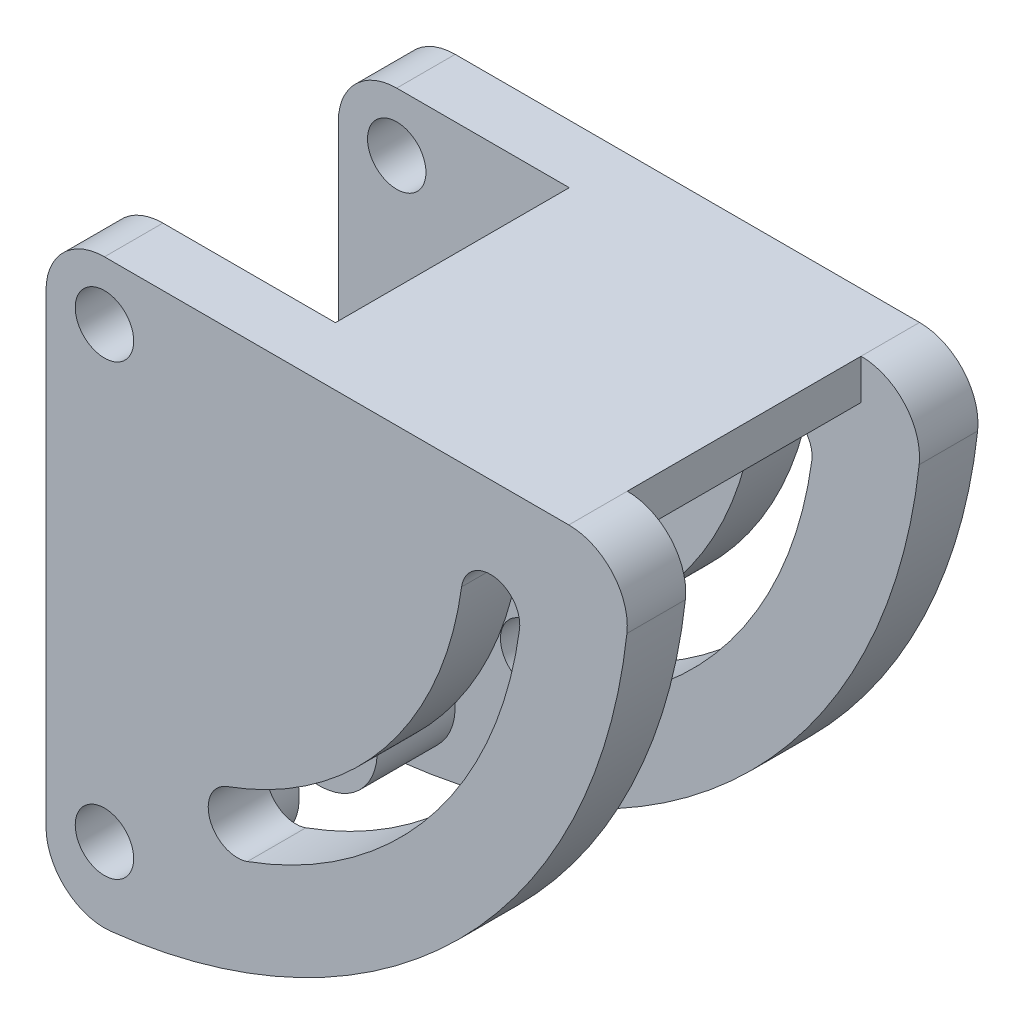
ISO-10303-21;
HEADER;
FILE_DESCRIPTION(('STEP AP214'),'2;1');
FILE_NAME('part.step','',(''),(''),'','','');
FILE_SCHEMA(('AUTOMOTIVE_DESIGN { 1 0 10303 214 1 1 1 1 }'));
ENDSEC;
DATA;
#1=APPLICATION_CONTEXT('core data for automotive mechanical design processes');
#2=APPLICATION_PROTOCOL_DEFINITION('international standard','automotive_design',2000,#1);
#3=PRODUCT_CONTEXT('',#1,'mechanical');
#4=PRODUCT('Part','Part','',(#3));
#5=PRODUCT_RELATED_PRODUCT_CATEGORY('part','',(#4));
#6=PRODUCT_DEFINITION_FORMATION('','',#4);
#7=PRODUCT_DEFINITION_CONTEXT('part definition',#1,'design');
#8=PRODUCT_DEFINITION('design','',#6,#7);
#9=PRODUCT_DEFINITION_SHAPE('','',#8);
#10=(LENGTH_UNIT() NAMED_UNIT(*) SI_UNIT(.MILLI.,.METRE.));
#11=(NAMED_UNIT(*) PLANE_ANGLE_UNIT() SI_UNIT($,.RADIAN.));
#12=(NAMED_UNIT(*) SI_UNIT($,.STERADIAN.) SOLID_ANGLE_UNIT());
#13=UNCERTAINTY_MEASURE_WITH_UNIT(LENGTH_MEASURE(1.E-05),#10,'distance_accuracy_value','');
#14=(GEOMETRIC_REPRESENTATION_CONTEXT(3) GLOBAL_UNCERTAINTY_ASSIGNED_CONTEXT((#13)) GLOBAL_UNIT_ASSIGNED_CONTEXT((#10,
#11,#12)) REPRESENTATION_CONTEXT('',''));
#15=CARTESIAN_POINT('',(0.,0.,0.));
#16=DIRECTION('',(0.,0.,1.));
#17=DIRECTION('',(1.,0.,0.));
#18=AXIS2_PLACEMENT_3D('',#15,#16,#17);
#19=CARTESIAN_POINT('',(0.,0.,3.));
#20=DIRECTION('',(0.,0.,1.));
#21=DIRECTION('',(1.,0.,0.));
#22=AXIS2_PLACEMENT_3D('',#19,#20,#21);
#23=PLANE('',#22);
#24=CARTESIAN_POINT('',(3.,-3.,3.));
#25=DIRECTION('',(0.,0.,1.));
#26=DIRECTION('',(1.,0.,0.));
#27=AXIS2_PLACEMENT_3D('',#24,#25,#26);
#28=CIRCLE('',#27,1.5);
#29=CARTESIAN_POINT('',(4.5,-3.,3.));
#30=VERTEX_POINT('',#29);
#31=EDGE_CURVE('E278',#30,#30,#28,.T.);
#32=ORIENTED_EDGE('',*,*,#31,.F.);
#33=EDGE_LOOP('',(#32));
#34=FACE_BOUND('',#33,.T.);
#35=CARTESIAN_POINT('',(3.,-3.,3.));
#36=DIRECTION('',(0.,0.,1.));
#37=DIRECTION('',(1.,0.,0.));
#38=AXIS2_PLACEMENT_3D('',#35,#36,#37);
#39=CIRCLE('',#38,21.5);
#40=CARTESIAN_POINT('',(10.3368607416251,-23.209415490261,3.));
#41=VERTEX_POINT('',#40);
#42=CARTESIAN_POINT('',(24.3019173366732,-5.91175510329082,3.));
#43=VERTEX_POINT('',#42);
#44=EDGE_CURVE('E289',#41,#43,#39,.T.);
#45=ORIENTED_EDGE('',*,*,#44,.F.);
#46=CARTESIAN_POINT('',(9.82498673639547,-21.7994562700102,3.));
#47=DIRECTION('',(0.,0.,1.));
#48=DIRECTION('',(1.,0.,0.));
#49=AXIS2_PLACEMENT_3D('',#46,#47,#48);
#50=CIRCLE('',#49,1.5);
#51=CARTESIAN_POINT('',(9.31311273116582,-20.3894970497594,3.));
#52=VERTEX_POINT('',#51);
#53=EDGE_CURVE('E287',#52,#41,#50,.T.);
#54=ORIENTED_EDGE('',*,*,#53,.F.);
#55=CARTESIAN_POINT('',(3.,-3.,3.));
#56=DIRECTION('',(0.,0.,-1.));
#57=DIRECTION('',(-1.,0.,0.));
#58=AXIS2_PLACEMENT_3D('',#55,#56,#57);
#59=CIRCLE('',#58,18.5);
#60=CARTESIAN_POINT('',(21.3295567780677,-5.5054636935293,3.));
#61=VERTEX_POINT('',#60);
#62=EDGE_CURVE('E295',#61,#52,#59,.T.);
#63=ORIENTED_EDGE('',*,*,#62,.F.);
#64=CARTESIAN_POINT('',(22.8157370573705,-5.70860939841005,3.));
#65=DIRECTION('',(0.,0.,1.));
#66=DIRECTION('',(1.,0.,0.));
#67=AXIS2_PLACEMENT_3D('',#64,#65,#66);
#68=CIRCLE('',#67,1.5);
#69=EDGE_CURVE('E292',#43,#61,#68,.T.);
#70=ORIENTED_EDGE('',*,*,#69,.F.);
#71=EDGE_LOOP('',(#45,#54,#63,#70));
#72=FACE_BOUND('',#71,.T.);
#73=DIRECTION('',(0.,-1.,0.));
#74=VECTOR('',#73,1.);
#75=CARTESIAN_POINT('',(0.,0.,3.));
#76=LINE('',#75,#74);
#77=CARTESIAN_POINT('',(0.,-3.,3.));
#78=VERTEX_POINT('',#77);
#79=CARTESIAN_POINT('',(0.,-26.,3.));
#80=VERTEX_POINT('',#79);
#81=EDGE_CURVE('E318',#78,#80,#76,.T.);
#82=ORIENTED_EDGE('',*,*,#81,.T.);
#83=CARTESIAN_POINT('',(3.,-26.,3.));
#84=DIRECTION('',(0.,0.,-1.));
#85=DIRECTION('',(-1.,0.,0.));
#86=AXIS2_PLACEMENT_3D('',#83,#84,#85);
#87=CIRCLE('',#86,3.);
#88=EDGE_CURVE('E47',#80,#80,#87,.T.);
#89=ORIENTED_EDGE('',*,*,#88,.T.);
#90=CARTESIAN_POINT('',(0.,-26.8328157299975,3.));
#91=VERTEX_POINT('',#90);
#92=EDGE_CURVE('E322',#80,#91,#76,.T.);
#93=ORIENTED_EDGE('',*,*,#92,.T.);
#94=CARTESIAN_POINT('',(3.,-26.8328157299975,3.));
#95=DIRECTION('',(0.,0.,1.));
#96=DIRECTION('',(1.,0.,0.));
#97=AXIS2_PLACEMENT_3D('',#94,#95,#96);
#98=CIRCLE('',#97,3.);
#99=CARTESIAN_POINT('',(3.33333333333334,-29.8142396999972,3.));
#100=VERTEX_POINT('',#99);
#101=EDGE_CURVE('E352',#91,#100,#98,.T.);
#102=ORIENTED_EDGE('',*,*,#101,.T.);
#103=CARTESIAN_POINT('',(0.,0.,3.));
#104=DIRECTION('',(0.,0.,1.));
#105=DIRECTION('',(1.,0.,0.));
#106=AXIS2_PLACEMENT_3D('',#103,#104,#105);
#107=CIRCLE('',#106,30.);
#108=CARTESIAN_POINT('',(29.8142396999972,-3.33333333333334,3.));
#109=VERTEX_POINT('',#108);
#110=EDGE_CURVE('E321',#100,#109,#107,.T.);
#111=ORIENTED_EDGE('',*,*,#110,.T.);
#112=CARTESIAN_POINT('',(26.8328157299975,-3.,3.));
#113=DIRECTION('',(0.,0.,1.));
#114=DIRECTION('',(1.,0.,0.));
#115=AXIS2_PLACEMENT_3D('',#112,#113,#114);
#116=CIRCLE('',#115,3.);
#117=CARTESIAN_POINT('',(26.8328157299975,0.,3.));
#118=VERTEX_POINT('',#117);
#119=EDGE_CURVE('E356',#109,#118,#116,.T.);
#120=ORIENTED_EDGE('',*,*,#119,.T.);
#121=DIRECTION('',(0.,1.,0.));
#122=VECTOR('',#121,1.);
#123=CARTESIAN_POINT('',(26.8328157299975,0.,3.));
#124=LINE('',#123,#122);
#125=CARTESIAN_POINT('',(26.8328157299975,-2.05882384585721,3.));
#126=VERTEX_POINT('',#125);
#127=EDGE_CURVE('E251',#126,#118,#124,.T.);
#128=ORIENTED_EDGE('',*,*,#127,.F.);
#129=DIRECTION('',(1.,0.,0.));
#130=VECTOR('',#129,1.);
#131=CARTESIAN_POINT('',(11.8552999571762,-2.05882384585721,3.));
#132=LINE('',#131,#130);
#133=CARTESIAN_POINT('',(11.8552999571762,-2.05882384585721,3.));
#134=VERTEX_POINT('',#133);
#135=EDGE_CURVE('E54',#134,#126,#132,.T.);
#136=ORIENTED_EDGE('',*,*,#135,.F.);
#137=DIRECTION('',(0.,-1.,0.));
#138=VECTOR('',#137,1.);
#139=CARTESIAN_POINT('',(11.8552999571762,0.,3.));
#140=LINE('',#139,#138);
#141=CARTESIAN_POINT('',(11.8552999571762,0.,3.));
#142=VERTEX_POINT('',#141);
#143=EDGE_CURVE('E255',#142,#134,#140,.T.);
#144=ORIENTED_EDGE('',*,*,#143,.F.);
#145=DIRECTION('',(-1.,0.,0.));
#146=VECTOR('',#145,1.);
#147=CARTESIAN_POINT('',(0.,0.,3.));
#148=LINE('',#147,#146);
#149=CARTESIAN_POINT('',(3.,0.,3.));
#150=VERTEX_POINT('',#149);
#151=EDGE_CURVE('E325',#142,#150,#148,.T.);
#152=ORIENTED_EDGE('',*,*,#151,.T.);
#153=CARTESIAN_POINT('',(3.,-3.,3.));
#154=DIRECTION('',(0.,0.,1.));
#155=DIRECTION('',(1.,0.,0.));
#156=AXIS2_PLACEMENT_3D('',#153,#154,#155);
#157=CIRCLE('',#156,3.);
#158=EDGE_CURVE('E354',#150,#78,#157,.T.);
#159=ORIENTED_EDGE('',*,*,#158,.T.);
#160=EDGE_LOOP('',(#82,#89,#93,#102,#111,#120,#128,#136,#144,#152,#159));
#161=FACE_BOUND('',#160,.T.);
#162=ADVANCED_FACE('F34',(#34,#72,#161),#23,.T.);
#163=CARTESIAN_POINT('',(0.,0.,15.));
#164=DIRECTION('',(0.,0.,1.));
#165=DIRECTION('',(1.,0.,0.));
#166=AXIS2_PLACEMENT_3D('',#163,#164,#165);
#167=PLANE('',#166);
#168=CARTESIAN_POINT('',(3.,-3.,15.));
#169=DIRECTION('',(0.,0.,1.));
#170=DIRECTION('',(1.,0.,0.));
#171=AXIS2_PLACEMENT_3D('',#168,#169,#170);
#172=CIRCLE('',#171,1.5);
#173=CARTESIAN_POINT('',(4.5,-3.,15.));
#174=VERTEX_POINT('',#173);
#175=EDGE_CURVE('E532',#174,#174,#172,.T.);
#176=ORIENTED_EDGE('',*,*,#175,.T.);
#177=EDGE_LOOP('',(#176));
#178=FACE_BOUND('',#177,.T.);
#179=CARTESIAN_POINT('',(9.82498673639547,-21.7994562700102,15.));
#180=DIRECTION('',(0.,0.,1.));
#181=DIRECTION('',(1.,0.,0.));
#182=AXIS2_PLACEMENT_3D('',#179,#180,#181);
#183=CIRCLE('',#182,1.5);
#184=CARTESIAN_POINT('',(9.31311273116582,-20.3894970497594,15.));
#185=VERTEX_POINT('',#184);
#186=CARTESIAN_POINT('',(10.3368607416251,-23.209415490261,15.));
#187=VERTEX_POINT('',#186);
#188=EDGE_CURVE('E542',#185,#187,#183,.T.);
#189=ORIENTED_EDGE('',*,*,#188,.T.);
#190=CARTESIAN_POINT('',(3.,-3.,15.));
#191=DIRECTION('',(0.,0.,1.));
#192=DIRECTION('',(1.,0.,0.));
#193=AXIS2_PLACEMENT_3D('',#190,#191,#192);
#194=CIRCLE('',#193,21.5);
#195=CARTESIAN_POINT('',(24.3019173366732,-5.91175510329082,15.));
#196=VERTEX_POINT('',#195);
#197=EDGE_CURVE('E556',#187,#196,#194,.T.);
#198=ORIENTED_EDGE('',*,*,#197,.T.);
#199=CARTESIAN_POINT('',(22.8157370573705,-5.70860939841005,15.));
#200=DIRECTION('',(0.,0.,1.));
#201=DIRECTION('',(1.,0.,0.));
#202=AXIS2_PLACEMENT_3D('',#199,#200,#201);
#203=CIRCLE('',#202,1.5);
#204=CARTESIAN_POINT('',(21.3295567780677,-5.5054636935293,15.));
#205=VERTEX_POINT('',#204);
#206=EDGE_CURVE('E559',#196,#205,#203,.T.);
#207=ORIENTED_EDGE('',*,*,#206,.T.);
#208=CARTESIAN_POINT('',(3.,-3.,15.));
#209=DIRECTION('',(0.,0.,-1.));
#210=DIRECTION('',(-1.,0.,0.));
#211=AXIS2_PLACEMENT_3D('',#208,#209,#210);
#212=CIRCLE('',#211,18.5);
#213=EDGE_CURVE('E546',#205,#185,#212,.T.);
#214=ORIENTED_EDGE('',*,*,#213,.T.);
#215=EDGE_LOOP('',(#189,#198,#207,#214));
#216=FACE_BOUND('',#215,.T.);
#217=DIRECTION('',(0.,-1.,0.));
#218=VECTOR('',#217,1.);
#219=CARTESIAN_POINT('',(0.,0.,15.));
#220=LINE('',#219,#218);
#221=CARTESIAN_POINT('',(0.,-26.,15.));
#222=VERTEX_POINT('',#221);
#223=CARTESIAN_POINT('',(0.,-26.8328157299975,15.));
#224=VERTEX_POINT('',#223);
#225=EDGE_CURVE('E198',#222,#224,#220,.T.);
#226=ORIENTED_EDGE('',*,*,#225,.F.);
#227=CARTESIAN_POINT('',(3.,-26.,15.));
#228=DIRECTION('',(0.,0.,-1.));
#229=DIRECTION('',(-1.,0.,0.));
#230=AXIS2_PLACEMENT_3D('',#227,#228,#229);
#231=CIRCLE('',#230,3.);
#232=EDGE_CURVE('E209',#222,#222,#231,.T.);
#233=ORIENTED_EDGE('',*,*,#232,.F.);
#234=CARTESIAN_POINT('',(0.,-3.,15.));
#235=VERTEX_POINT('',#234);
#236=EDGE_CURVE('E194',#235,#222,#220,.T.);
#237=ORIENTED_EDGE('',*,*,#236,.F.);
#238=CARTESIAN_POINT('',(3.,-3.,15.));
#239=DIRECTION('',(0.,0.,1.));
#240=DIRECTION('',(1.,0.,0.));
#241=AXIS2_PLACEMENT_3D('',#238,#239,#240);
#242=CIRCLE('',#241,3.);
#243=CARTESIAN_POINT('',(3.,0.,15.));
#244=VERTEX_POINT('',#243);
#245=EDGE_CURVE('E232',#235,#244,#242,.F.);
#246=ORIENTED_EDGE('',*,*,#245,.T.);
#247=DIRECTION('',(-1.,0.,0.));
#248=VECTOR('',#247,1.);
#249=CARTESIAN_POINT('',(0.,0.,15.));
#250=LINE('',#249,#248);
#251=CARTESIAN_POINT('',(11.8552999571762,0.,14.9999999999864));
#252=VERTEX_POINT('',#251);
#253=EDGE_CURVE('E223',#252,#244,#250,.T.);
#254=ORIENTED_EDGE('',*,*,#253,.F.);
#255=DIRECTION('',(0.,-1.,0.));
#256=VECTOR('',#255,1.);
#257=CARTESIAN_POINT('',(11.8552999571762,0.,14.9999999999864));
#258=LINE('',#257,#256);
#259=CARTESIAN_POINT('',(11.8552999571762,-2.05882384585721,14.9999999999864));
#260=VERTEX_POINT('',#259);
#261=EDGE_CURVE('E263',#252,#260,#258,.T.);
#262=ORIENTED_EDGE('',*,*,#261,.T.);
#263=DIRECTION('',(1.,0.,0.));
#264=VECTOR('',#263,1.);
#265=CARTESIAN_POINT('',(11.8552999571762,-2.05882384585721,14.9999999999864));
#266=LINE('',#265,#264);
#267=CARTESIAN_POINT('',(26.8328157299975,-2.05882384585721,14.9999999999864));
#268=VERTEX_POINT('',#267);
#269=EDGE_CURVE('E273',#260,#268,#266,.T.);
#270=ORIENTED_EDGE('',*,*,#269,.T.);
#271=DIRECTION('',(0.,1.,0.));
#272=VECTOR('',#271,1.);
#273=CARTESIAN_POINT('',(26.8328157299975,0.,14.9999999999864));
#274=LINE('',#273,#272);
#275=CARTESIAN_POINT('',(26.8328157299975,0.,15.));
#276=VERTEX_POINT('',#275);
#277=EDGE_CURVE('E250',#268,#276,#274,.T.);
#278=ORIENTED_EDGE('',*,*,#277,.T.);
#279=CARTESIAN_POINT('',(26.8328157299975,-3.,15.));
#280=DIRECTION('',(0.,0.,1.));
#281=DIRECTION('',(1.,0.,0.));
#282=AXIS2_PLACEMENT_3D('',#279,#280,#281);
#283=CIRCLE('',#282,3.);
#284=CARTESIAN_POINT('',(29.8142396999972,-3.33333333333334,15.));
#285=VERTEX_POINT('',#284);
#286=EDGE_CURVE('E234',#276,#285,#283,.F.);
#287=ORIENTED_EDGE('',*,*,#286,.T.);
#288=CARTESIAN_POINT('',(0.,0.,15.));
#289=DIRECTION('',(0.,0.,1.));
#290=DIRECTION('',(1.,0.,0.));
#291=AXIS2_PLACEMENT_3D('',#288,#289,#290);
#292=CIRCLE('',#291,30.);
#293=CARTESIAN_POINT('',(3.33333333333334,-29.8142396999972,15.));
#294=VERTEX_POINT('',#293);
#295=EDGE_CURVE('E205',#294,#285,#292,.T.);
#296=ORIENTED_EDGE('',*,*,#295,.F.);
#297=CARTESIAN_POINT('',(3.,-26.8328157299975,15.));
#298=DIRECTION('',(0.,0.,1.));
#299=DIRECTION('',(1.,0.,0.));
#300=AXIS2_PLACEMENT_3D('',#297,#298,#299);
#301=CIRCLE('',#300,3.);
#302=EDGE_CURVE('E211',#294,#224,#301,.F.);
#303=ORIENTED_EDGE('',*,*,#302,.T.);
#304=EDGE_LOOP('',(#226,#233,#237,#246,#254,#262,#270,#278,#287,#296,#303));
#305=FACE_BOUND('',#304,.T.);
#306=ADVANCED_FACE('F207',(#178,#216,#305),#167,.F.);
#307=CARTESIAN_POINT('',(0.,0.,0.));
#308=DIRECTION('',(0.,0.,1.));
#309=DIRECTION('',(1.,0.,0.));
#310=AXIS2_PLACEMENT_3D('',#307,#308,#309);
#311=PLANE('',#310);
#312=DIRECTION('',(-1.,0.,0.));
#313=VECTOR('',#312,1.);
#314=CARTESIAN_POINT('',(0.,0.,0.));
#315=LINE('',#314,#313);
#316=CARTESIAN_POINT('',(26.8328157299975,0.,0.));
#317=VERTEX_POINT('',#316);
#318=CARTESIAN_POINT('',(3.,0.,0.));
#319=VERTEX_POINT('',#318);
#320=EDGE_CURVE('E333',#317,#319,#315,.T.);
#321=ORIENTED_EDGE('',*,*,#320,.F.);
#322=CARTESIAN_POINT('',(26.8328157299975,-3.,0.));
#323=DIRECTION('',(0.,0.,1.));
#324=DIRECTION('',(1.,0.,0.));
#325=AXIS2_PLACEMENT_3D('',#322,#323,#324);
#326=CIRCLE('',#325,3.);
#327=CARTESIAN_POINT('',(29.8142396999972,-3.33333333333334,0.));
#328=VERTEX_POINT('',#327);
#329=EDGE_CURVE('E345',#317,#328,#326,.F.);
#330=ORIENTED_EDGE('',*,*,#329,.T.);
#331=CARTESIAN_POINT('',(0.,0.,0.));
#332=DIRECTION('',(0.,0.,1.));
#333=DIRECTION('',(1.,0.,0.));
#334=AXIS2_PLACEMENT_3D('',#331,#332,#333);
#335=CIRCLE('',#334,30.);
#336=CARTESIAN_POINT('',(3.33333333333334,-29.8142396999972,0.));
#337=VERTEX_POINT('',#336);
#338=EDGE_CURVE('E330',#337,#328,#335,.T.);
#339=ORIENTED_EDGE('',*,*,#338,.F.);
#340=CARTESIAN_POINT('',(3.,-26.8328157299975,0.));
#341=DIRECTION('',(0.,0.,1.));
#342=DIRECTION('',(1.,0.,0.));
#343=AXIS2_PLACEMENT_3D('',#340,#341,#342);
#344=CIRCLE('',#343,3.);
#345=CARTESIAN_POINT('',(0.,-26.8328157299975,0.));
#346=VERTEX_POINT('',#345);
#347=EDGE_CURVE('E341',#337,#346,#344,.F.);
#348=ORIENTED_EDGE('',*,*,#347,.T.);
#349=DIRECTION('',(0.,-1.,0.));
#350=VECTOR('',#349,1.);
#351=CARTESIAN_POINT('',(0.,0.,0.));
#352=LINE('',#351,#350);
#353=CARTESIAN_POINT('',(0.,-3.,0.));
#354=VERTEX_POINT('',#353);
#355=EDGE_CURVE('E317',#354,#346,#352,.T.);
#356=ORIENTED_EDGE('',*,*,#355,.F.);
#357=CARTESIAN_POINT('',(3.,-3.,0.));
#358=DIRECTION('',(0.,0.,1.));
#359=DIRECTION('',(1.,0.,0.));
#360=AXIS2_PLACEMENT_3D('',#357,#358,#359);
#361=CIRCLE('',#360,3.);
#362=EDGE_CURVE('E343',#354,#319,#361,.F.);
#363=ORIENTED_EDGE('',*,*,#362,.T.);
#364=EDGE_LOOP('',(#321,#330,#339,#348,#356,#363));
#365=FACE_BOUND('',#364,.T.);
#366=CARTESIAN_POINT('',(9.82498673639547,-21.7994562700102,0.));
#367=DIRECTION('',(0.,0.,1.));
#368=DIRECTION('',(1.,0.,0.));
#369=AXIS2_PLACEMENT_3D('',#366,#367,#368);
#370=CIRCLE('',#369,1.5);
#371=CARTESIAN_POINT('',(9.31311273116582,-20.3894970497594,0.));
#372=VERTEX_POINT('',#371);
#373=CARTESIAN_POINT('',(10.3368607416251,-23.209415490261,0.));
#374=VERTEX_POINT('',#373);
#375=EDGE_CURVE('E286',#372,#374,#370,.T.);
#376=ORIENTED_EDGE('',*,*,#375,.T.);
#377=CARTESIAN_POINT('',(3.,-3.,0.));
#378=DIRECTION('',(0.,0.,1.));
#379=DIRECTION('',(1.,0.,0.));
#380=AXIS2_PLACEMENT_3D('',#377,#378,#379);
#381=CIRCLE('',#380,21.5);
#382=CARTESIAN_POINT('',(24.3019173366732,-5.91175510329082,0.));
#383=VERTEX_POINT('',#382);
#384=EDGE_CURVE('E300',#374,#383,#381,.T.);
#385=ORIENTED_EDGE('',*,*,#384,.T.);
#386=CARTESIAN_POINT('',(22.8157370573705,-5.70860939841005,0.));
#387=DIRECTION('',(0.,0.,1.));
#388=DIRECTION('',(1.,0.,0.));
#389=AXIS2_PLACEMENT_3D('',#386,#387,#388);
#390=CIRCLE('',#389,1.5);
#391=CARTESIAN_POINT('',(21.3295567780677,-5.5054636935293,0.));
#392=VERTEX_POINT('',#391);
#393=EDGE_CURVE('E303',#383,#392,#390,.T.);
#394=ORIENTED_EDGE('',*,*,#393,.T.);
#395=CARTESIAN_POINT('',(3.,-3.,0.));
#396=DIRECTION('',(0.,0.,-1.));
#397=DIRECTION('',(-1.,0.,0.));
#398=AXIS2_PLACEMENT_3D('',#395,#396,#397);
#399=CIRCLE('',#398,18.5);
#400=EDGE_CURVE('E290',#392,#372,#399,.T.);
#401=ORIENTED_EDGE('',*,*,#400,.T.);
#402=EDGE_LOOP('',(#376,#385,#394,#401));
#403=FACE_BOUND('',#402,.T.);
#404=CARTESIAN_POINT('',(3.,-26.,0.));
#405=DIRECTION('',(0.,0.,1.));
#406=DIRECTION('',(1.,0.,0.));
#407=AXIS2_PLACEMENT_3D('',#404,#405,#406);
#408=CIRCLE('',#407,1.5);
#409=CARTESIAN_POINT('',(4.5,-26.,0.));
#410=VERTEX_POINT('',#409);
#411=EDGE_CURVE('E281',#410,#410,#408,.T.);
#412=ORIENTED_EDGE('',*,*,#411,.T.);
#413=EDGE_LOOP('',(#412));
#414=FACE_BOUND('',#413,.T.);
#415=CARTESIAN_POINT('',(3.,-3.,0.));
#416=DIRECTION('',(0.,0.,1.));
#417=DIRECTION('',(1.,0.,0.));
#418=AXIS2_PLACEMENT_3D('',#415,#416,#417);
#419=CIRCLE('',#418,1.5);
#420=CARTESIAN_POINT('',(4.5,-3.,0.));
#421=VERTEX_POINT('',#420);
#422=EDGE_CURVE('E258',#421,#421,#419,.T.);
#423=ORIENTED_EDGE('',*,*,#422,.T.);
#424=EDGE_LOOP('',(#423));
#425=FACE_BOUND('',#424,.T.);
#426=ADVANCED_FACE('F396',(#365,#403,#414,#425),#311,.F.);
#427=CARTESIAN_POINT('',(0.,0.,3.));
#428=DIRECTION('',(1.,0.,0.));
#429=DIRECTION('',(0.,1.,0.));
#430=AXIS2_PLACEMENT_3D('',#427,#428,#429);
#431=PLANE('',#430);
#432=ORIENTED_EDGE('',*,*,#81,.F.);
#433=DIRECTION('',(0.,0.,-1.));
#434=VECTOR('',#433,1.);
#435=CARTESIAN_POINT('',(0.,-3.,3.));
#436=LINE('',#435,#434);
#437=EDGE_CURVE('E11',#78,#354,#436,.T.);
#438=ORIENTED_EDGE('',*,*,#437,.T.);
#439=ORIENTED_EDGE('',*,*,#355,.T.);
#440=DIRECTION('',(0.,0.,-1.));
#441=VECTOR('',#440,1.);
#442=CARTESIAN_POINT('',(0.,-26.8328157299975,3.));
#443=LINE('',#442,#441);
#444=EDGE_CURVE('E42',#346,#91,#443,.F.);
#445=ORIENTED_EDGE('',*,*,#444,.T.);
#446=ORIENTED_EDGE('',*,*,#92,.F.);
#447=EDGE_LOOP('',(#432,#438,#439,#445,#446));
#448=FACE_BOUND('',#447,.T.);
#449=ADVANCED_FACE('F363',(#448),#431,.F.);
#450=CARTESIAN_POINT('',(0.,0.,3.));
#451=DIRECTION('',(0.,0.,-1.));
#452=DIRECTION('',(-1.,0.,0.));
#453=AXIS2_PLACEMENT_3D('',#450,#451,#452);
#454=CYLINDRICAL_SURFACE('',#453,30.);
#455=ORIENTED_EDGE('',*,*,#338,.T.);
#456=DIRECTION('',(0.,0.,-1.));
#457=VECTOR('',#456,1.);
#458=CARTESIAN_POINT('',(29.8142396999972,-3.33333333333334,3.));
#459=LINE('',#458,#457);
#460=EDGE_CURVE('E350',#328,#109,#459,.F.);
#461=ORIENTED_EDGE('',*,*,#460,.T.);
#462=ORIENTED_EDGE('',*,*,#110,.F.);
#463=DIRECTION('',(0.,0.,-1.));
#464=VECTOR('',#463,1.);
#465=CARTESIAN_POINT('',(3.33333333333334,-29.8142396999972,3.));
#466=LINE('',#465,#464);
#467=EDGE_CURVE('E347',#100,#337,#466,.T.);
#468=ORIENTED_EDGE('',*,*,#467,.T.);
#469=EDGE_LOOP('',(#455,#461,#462,#468));
#470=FACE_BOUND('',#469,.T.);
#471=ADVANCED_FACE('F370',(#470),#454,.T.);
#472=CARTESIAN_POINT('',(0.,0.,3.));
#473=DIRECTION('',(0.,-1.,0.));
#474=DIRECTION('',(1.,0.,0.));
#475=AXIS2_PLACEMENT_3D('',#472,#473,#474);
#476=PLANE('',#475);
#477=ORIENTED_EDGE('',*,*,#151,.F.);
#478=DIRECTION('',(0.,0.,-1.));
#479=VECTOR('',#478,1.);
#480=CARTESIAN_POINT('',(11.8552999571762,0.,500000.));
#481=LINE('',#480,#479);
#482=EDGE_CURVE('E254',#252,#142,#481,.T.);
#483=ORIENTED_EDGE('',*,*,#482,.F.);
#484=ORIENTED_EDGE('',*,*,#253,.T.);
#485=DIRECTION('',(0.,0.,-1.));
#486=VECTOR('',#485,1.);
#487=CARTESIAN_POINT('',(3.,0.,18.));
#488=LINE('',#487,#486);
#489=CARTESIAN_POINT('',(3.,0.,18.));
#490=VERTEX_POINT('',#489);
#491=EDGE_CURVE('E226',#244,#490,#488,.F.);
#492=ORIENTED_EDGE('',*,*,#491,.T.);
#493=DIRECTION('',(-1.,0.,0.));
#494=VECTOR('',#493,1.);
#495=CARTESIAN_POINT('',(0.,0.,18.));
#496=LINE('',#495,#494);
#497=CARTESIAN_POINT('',(26.8328157299975,0.,18.));
#498=VERTEX_POINT('',#497);
#499=EDGE_CURVE('E219',#498,#490,#496,.T.);
#500=ORIENTED_EDGE('',*,*,#499,.F.);
#501=DIRECTION('',(0.,0.,-1.));
#502=VECTOR('',#501,1.);
#503=CARTESIAN_POINT('',(26.8328157299975,0.,18.));
#504=LINE('',#503,#502);
#505=EDGE_CURVE('E228',#498,#276,#504,.T.);
#506=ORIENTED_EDGE('',*,*,#505,.T.);
#507=DIRECTION('',(0.,0.,-1.));
#508=VECTOR('',#507,1.);
#509=CARTESIAN_POINT('',(26.8328157299975,0.,500000.));
#510=LINE('',#509,#508);
#511=EDGE_CURVE('E266',#276,#118,#510,.T.);
#512=ORIENTED_EDGE('',*,*,#511,.T.);
#513=DIRECTION('',(0.,0.,-1.));
#514=VECTOR('',#513,1.);
#515=CARTESIAN_POINT('',(26.8328157299975,0.,3.));
#516=LINE('',#515,#514);
#517=EDGE_CURVE('E338',#118,#317,#516,.T.);
#518=ORIENTED_EDGE('',*,*,#517,.T.);
#519=ORIENTED_EDGE('',*,*,#320,.T.);
#520=DIRECTION('',(0.,0.,-1.));
#521=VECTOR('',#520,1.);
#522=CARTESIAN_POINT('',(3.,0.,3.));
#523=LINE('',#522,#521);
#524=EDGE_CURVE('E327',#319,#150,#523,.F.);
#525=ORIENTED_EDGE('',*,*,#524,.T.);
#526=EDGE_LOOP('',(#477,#483,#484,#492,#500,#506,#512,#518,#519,#525));
#527=FACE_BOUND('',#526,.T.);
#528=ADVANCED_FACE('F387',(#527),#476,.F.);
#529=CARTESIAN_POINT('',(9.82498673639547,-21.7994562700102,3.));
#530=DIRECTION('',(0.,0.,-1.));
#531=DIRECTION('',(-1.,0.,0.));
#532=AXIS2_PLACEMENT_3D('',#529,#530,#531);
#533=CYLINDRICAL_SURFACE('',#532,1.5);
#534=ORIENTED_EDGE('',*,*,#375,.F.);
#535=DIRECTION('',(0.,0.,-1.));
#536=VECTOR('',#535,1.);
#537=CARTESIAN_POINT('',(9.31311273116582,-20.3894970497594,3.));
#538=LINE('',#537,#536);
#539=EDGE_CURVE('E297',#52,#372,#538,.T.);
#540=ORIENTED_EDGE('',*,*,#539,.F.);
#541=ORIENTED_EDGE('',*,*,#53,.T.);
#542=DIRECTION('',(0.,0.,-1.));
#543=VECTOR('',#542,1.);
#544=CARTESIAN_POINT('',(10.3368607416251,-23.209415490261,3.));
#545=LINE('',#544,#543);
#546=EDGE_CURVE('E314',#41,#374,#545,.T.);
#547=ORIENTED_EDGE('',*,*,#546,.T.);
#548=EDGE_LOOP('',(#534,#540,#541,#547));
#549=FACE_BOUND('',#548,.T.);
#550=ADVANCED_FACE('F430',(#549),#533,.F.);
#551=CARTESIAN_POINT('',(3.,-3.,3.));
#552=DIRECTION('',(0.,0.,-1.));
#553=DIRECTION('',(-1.,0.,0.));
#554=AXIS2_PLACEMENT_3D('',#551,#552,#553);
#555=CYLINDRICAL_SURFACE('',#554,21.5);
#556=ORIENTED_EDGE('',*,*,#384,.F.);
#557=ORIENTED_EDGE('',*,*,#546,.F.);
#558=ORIENTED_EDGE('',*,*,#44,.T.);
#559=DIRECTION('',(0.,0.,-1.));
#560=VECTOR('',#559,1.);
#561=CARTESIAN_POINT('',(24.3019173366732,-5.91175510329082,3.));
#562=LINE('',#561,#560);
#563=EDGE_CURVE('E312',#43,#383,#562,.T.);
#564=ORIENTED_EDGE('',*,*,#563,.T.);
#565=EDGE_LOOP('',(#556,#557,#558,#564));
#566=FACE_BOUND('',#565,.T.);
#567=ADVANCED_FACE('F792',(#566),#555,.F.);
#568=CARTESIAN_POINT('',(22.8157370573705,-5.70860939841005,3.));
#569=DIRECTION('',(0.,0.,-1.));
#570=DIRECTION('',(-1.,0.,0.));
#571=AXIS2_PLACEMENT_3D('',#568,#569,#570);
#572=CYLINDRICAL_SURFACE('',#571,1.5);
#573=ORIENTED_EDGE('',*,*,#393,.F.);
#574=ORIENTED_EDGE('',*,*,#563,.F.);
#575=ORIENTED_EDGE('',*,*,#69,.T.);
#576=DIRECTION('',(0.,0.,-1.));
#577=VECTOR('',#576,1.);
#578=CARTESIAN_POINT('',(21.3295567780677,-5.5054636935293,3.));
#579=LINE('',#578,#577);
#580=EDGE_CURVE('E310',#61,#392,#579,.T.);
#581=ORIENTED_EDGE('',*,*,#580,.T.);
#582=EDGE_LOOP('',(#573,#574,#575,#581));
#583=FACE_BOUND('',#582,.T.);
#584=ADVANCED_FACE('F782',(#583),#572,.F.);
#585=CARTESIAN_POINT('',(3.,-3.,3.));
#586=DIRECTION('',(0.,0.,-1.));
#587=DIRECTION('',(-1.,0.,0.));
#588=AXIS2_PLACEMENT_3D('',#585,#586,#587);
#589=CYLINDRICAL_SURFACE('',#588,18.5);
#590=ORIENTED_EDGE('',*,*,#400,.F.);
#591=ORIENTED_EDGE('',*,*,#580,.F.);
#592=ORIENTED_EDGE('',*,*,#62,.T.);
#593=ORIENTED_EDGE('',*,*,#539,.T.);
#594=EDGE_LOOP('',(#590,#591,#592,#593));
#595=FACE_BOUND('',#594,.T.);
#596=ADVANCED_FACE('F415',(#595),#589,.T.);
#597=CARTESIAN_POINT('',(3.,-26.,3.));
#598=DIRECTION('',(0.,0.,-1.));
#599=DIRECTION('',(-1.,0.,0.));
#600=AXIS2_PLACEMENT_3D('',#597,#598,#599);
#601=CYLINDRICAL_SURFACE('',#600,1.5);
#602=ORIENTED_EDGE('',*,*,#411,.F.);
#603=EDGE_LOOP('',(#602));
#604=FACE_BOUND('',#603,.T.);
#605=CARTESIAN_POINT('',(3.,-26.,7.));
#606=DIRECTION('',(0.,0.,-1.));
#607=DIRECTION('',(-1.,0.,0.));
#608=AXIS2_PLACEMENT_3D('',#605,#606,#607);
#609=CIRCLE('',#608,1.5);
#610=CARTESIAN_POINT('',(1.5,-26.,7.));
#611=VERTEX_POINT('',#610);
#612=EDGE_CURVE('E520',#611,#611,#609,.T.);
#613=ORIENTED_EDGE('',*,*,#612,.F.);
#614=EDGE_LOOP('',(#613));
#615=FACE_BOUND('',#614,.T.);
#616=ADVANCED_FACE('F407',(#604,#615),#601,.F.);
#617=CARTESIAN_POINT('',(3.,-3.,3.));
#618=DIRECTION('',(0.,0.,-1.));
#619=DIRECTION('',(-1.,0.,0.));
#620=AXIS2_PLACEMENT_3D('',#617,#618,#619);
#621=CYLINDRICAL_SURFACE('',#620,1.5);
#622=ORIENTED_EDGE('',*,*,#31,.T.);
#623=EDGE_LOOP('',(#622));
#624=FACE_BOUND('',#623,.T.);
#625=ORIENTED_EDGE('',*,*,#422,.F.);
#626=EDGE_LOOP('',(#625));
#627=FACE_BOUND('',#626,.T.);
#628=ADVANCED_FACE('F405',(#624,#627),#621,.F.);
#629=CARTESIAN_POINT('',(26.8328157299975,-3.,3.));
#630=DIRECTION('',(0.,0.,-1.));
#631=DIRECTION('',(-1.,0.,0.));
#632=AXIS2_PLACEMENT_3D('',#629,#630,#631);
#633=CYLINDRICAL_SURFACE('',#632,3.);
#634=ORIENTED_EDGE('',*,*,#119,.F.);
#635=ORIENTED_EDGE('',*,*,#460,.F.);
#636=ORIENTED_EDGE('',*,*,#329,.F.);
#637=ORIENTED_EDGE('',*,*,#517,.F.);
#638=EDGE_LOOP('',(#634,#635,#636,#637));
#639=FACE_BOUND('',#638,.T.);
#640=ADVANCED_FACE('F374',(#639),#633,.T.);
#641=CARTESIAN_POINT('',(3.,-3.,3.));
#642=DIRECTION('',(0.,0.,-1.));
#643=DIRECTION('',(-1.,0.,0.));
#644=AXIS2_PLACEMENT_3D('',#641,#642,#643);
#645=CYLINDRICAL_SURFACE('',#644,3.);
#646=ORIENTED_EDGE('',*,*,#158,.F.);
#647=ORIENTED_EDGE('',*,*,#524,.F.);
#648=ORIENTED_EDGE('',*,*,#362,.F.);
#649=ORIENTED_EDGE('',*,*,#437,.F.);
#650=EDGE_LOOP('',(#646,#647,#648,#649));
#651=FACE_BOUND('',#650,.T.);
#652=ADVANCED_FACE('F394',(#651),#645,.T.);
#653=CARTESIAN_POINT('',(3.,-26.8328157299975,3.));
#654=DIRECTION('',(0.,0.,-1.));
#655=DIRECTION('',(-1.,0.,0.));
#656=AXIS2_PLACEMENT_3D('',#653,#654,#655);
#657=CYLINDRICAL_SURFACE('',#656,3.);
#658=ORIENTED_EDGE('',*,*,#101,.F.);
#659=ORIENTED_EDGE('',*,*,#444,.F.);
#660=ORIENTED_EDGE('',*,*,#347,.F.);
#661=ORIENTED_EDGE('',*,*,#467,.F.);
#662=EDGE_LOOP('',(#658,#659,#660,#661));
#663=FACE_BOUND('',#662,.T.);
#664=ADVANCED_FACE('F36',(#663),#657,.T.);
#665=CARTESIAN_POINT('',(11.8552999571762,0.,500000.));
#666=DIRECTION('',(1.,0.,0.));
#667=DIRECTION('',(0.,0.,-1.));
#668=AXIS2_PLACEMENT_3D('',#665,#666,#667);
#669=PLANE('',#668);
#670=ORIENTED_EDGE('',*,*,#261,.F.);
#671=ORIENTED_EDGE('',*,*,#482,.T.);
#672=ORIENTED_EDGE('',*,*,#143,.T.);
#673=DIRECTION('',(0.,0.,-1.));
#674=VECTOR('',#673,1.);
#675=CARTESIAN_POINT('',(11.8552999571762,-2.05882384585721,500000.));
#676=LINE('',#675,#674);
#677=EDGE_CURVE('E260',#260,#134,#676,.T.);
#678=ORIENTED_EDGE('',*,*,#677,.F.);
#679=EDGE_LOOP('',(#670,#671,#672,#678));
#680=FACE_BOUND('',#679,.T.);
#681=ADVANCED_FACE('F383',(#680),#669,.F.);
#682=CARTESIAN_POINT('',(11.8552999571762,-2.05882384585721,500000.));
#683=DIRECTION('',(0.,1.,0.));
#684=DIRECTION('',(0.,0.,1.));
#685=AXIS2_PLACEMENT_3D('',#682,#683,#684);
#686=PLANE('',#685);
#687=ORIENTED_EDGE('',*,*,#269,.F.);
#688=ORIENTED_EDGE('',*,*,#677,.T.);
#689=ORIENTED_EDGE('',*,*,#135,.T.);
#690=DIRECTION('',(0.,0.,-1.));
#691=VECTOR('',#690,1.);
#692=CARTESIAN_POINT('',(26.8328157299975,-2.05882384585721,500000.));
#693=LINE('',#692,#691);
#694=EDGE_CURVE('E262',#268,#126,#693,.T.);
#695=ORIENTED_EDGE('',*,*,#694,.F.);
#696=EDGE_LOOP('',(#687,#688,#689,#695));
#697=FACE_BOUND('',#696,.T.);
#698=ADVANCED_FACE('F380',(#697),#686,.F.);
#699=CARTESIAN_POINT('',(26.8328157299975,0.,500000.));
#700=DIRECTION('',(-1.,0.,0.));
#701=DIRECTION('',(0.,0.,1.));
#702=AXIS2_PLACEMENT_3D('',#699,#700,#701);
#703=PLANE('',#702);
#704=ORIENTED_EDGE('',*,*,#277,.F.);
#705=ORIENTED_EDGE('',*,*,#694,.T.);
#706=ORIENTED_EDGE('',*,*,#127,.T.);
#707=ORIENTED_EDGE('',*,*,#511,.F.);
#708=EDGE_LOOP('',(#704,#705,#706,#707));
#709=FACE_BOUND('',#708,.T.);
#710=ADVANCED_FACE('F378',(#709),#703,.F.);
#711=CARTESIAN_POINT('',(0.,0.,18.));
#712=DIRECTION('',(0.,0.,1.));
#713=DIRECTION('',(1.,0.,0.));
#714=AXIS2_PLACEMENT_3D('',#711,#712,#713);
#715=PLANE('',#714);
#716=CARTESIAN_POINT('',(3.,-26.,18.));
#717=DIRECTION('',(0.,0.,1.));
#718=DIRECTION('',(1.,0.,0.));
#719=AXIS2_PLACEMENT_3D('',#716,#717,#718);
#720=CIRCLE('',#719,1.5);
#721=CARTESIAN_POINT('',(4.5,-26.,18.));
#722=VERTEX_POINT('',#721);
#723=EDGE_CURVE('E537',#722,#722,#720,.T.);
#724=ORIENTED_EDGE('',*,*,#723,.F.);
#725=EDGE_LOOP('',(#724));
#726=FACE_BOUND('',#725,.T.);
#727=CARTESIAN_POINT('',(0.,0.,18.));
#728=DIRECTION('',(0.,0.,1.));
#729=DIRECTION('',(1.,0.,0.));
#730=AXIS2_PLACEMENT_3D('',#727,#728,#729);
#731=CIRCLE('',#730,30.);
#732=CARTESIAN_POINT('',(3.33333333333334,-29.8142396999972,18.));
#733=VERTEX_POINT('',#732);
#734=CARTESIAN_POINT('',(29.8142396999972,-3.33333333333334,18.));
#735=VERTEX_POINT('',#734);
#736=EDGE_CURVE('E570',#733,#735,#731,.T.);
#737=ORIENTED_EDGE('',*,*,#736,.T.);
#738=CARTESIAN_POINT('',(26.8328157299975,-3.,18.));
#739=DIRECTION('',(0.,0.,1.));
#740=DIRECTION('',(1.,0.,0.));
#741=AXIS2_PLACEMENT_3D('',#738,#739,#740);
#742=CIRCLE('',#741,3.);
#743=EDGE_CURVE('E245',#735,#498,#742,.T.);
#744=ORIENTED_EDGE('',*,*,#743,.T.);
#745=ORIENTED_EDGE('',*,*,#499,.T.);
#746=CARTESIAN_POINT('',(3.,-3.,18.));
#747=DIRECTION('',(0.,0.,1.));
#748=DIRECTION('',(1.,0.,0.));
#749=AXIS2_PLACEMENT_3D('',#746,#747,#748);
#750=CIRCLE('',#749,3.);
#751=CARTESIAN_POINT('',(0.,-3.,18.));
#752=VERTEX_POINT('',#751);
#753=EDGE_CURVE('E243',#490,#752,#750,.T.);
#754=ORIENTED_EDGE('',*,*,#753,.T.);
#755=DIRECTION('',(0.,-1.,0.));
#756=VECTOR('',#755,1.);
#757=CARTESIAN_POINT('',(0.,0.,18.));
#758=LINE('',#757,#756);
#759=CARTESIAN_POINT('',(0.,-26.8328157299975,18.));
#760=VERTEX_POINT('',#759);
#761=EDGE_CURVE('E225',#752,#760,#758,.T.);
#762=ORIENTED_EDGE('',*,*,#761,.T.);
#763=CARTESIAN_POINT('',(3.,-26.8328157299975,18.));
#764=DIRECTION('',(0.,0.,1.));
#765=DIRECTION('',(1.,0.,0.));
#766=AXIS2_PLACEMENT_3D('',#763,#764,#765);
#767=CIRCLE('',#766,3.);
#768=EDGE_CURVE('E241',#760,#733,#767,.T.);
#769=ORIENTED_EDGE('',*,*,#768,.T.);
#770=EDGE_LOOP('',(#737,#744,#745,#754,#762,#769));
#771=FACE_BOUND('',#770,.T.);
#772=CARTESIAN_POINT('',(3.,-3.,18.));
#773=DIRECTION('',(0.,0.,1.));
#774=DIRECTION('',(1.,0.,0.));
#775=AXIS2_PLACEMENT_3D('',#772,#773,#774);
#776=CIRCLE('',#775,21.5);
#777=CARTESIAN_POINT('',(10.3368607416251,-23.209415490261,18.));
#778=VERTEX_POINT('',#777);
#779=CARTESIAN_POINT('',(24.3019173366732,-5.91175510329082,18.));
#780=VERTEX_POINT('',#779);
#781=EDGE_CURVE('E545',#778,#780,#776,.T.);
#782=ORIENTED_EDGE('',*,*,#781,.F.);
#783=CARTESIAN_POINT('',(9.82498673639547,-21.7994562700102,18.));
#784=DIRECTION('',(0.,0.,1.));
#785=DIRECTION('',(1.,0.,0.));
#786=AXIS2_PLACEMENT_3D('',#783,#784,#785);
#787=CIRCLE('',#786,1.5);
#788=CARTESIAN_POINT('',(9.31311273116582,-20.3894970497594,18.));
#789=VERTEX_POINT('',#788);
#790=EDGE_CURVE('E543',#789,#778,#787,.T.);
#791=ORIENTED_EDGE('',*,*,#790,.F.);
#792=CARTESIAN_POINT('',(3.,-3.,18.));
#793=DIRECTION('',(0.,0.,-1.));
#794=DIRECTION('',(-1.,0.,0.));
#795=AXIS2_PLACEMENT_3D('',#792,#793,#794);
#796=CIRCLE('',#795,18.5);
#797=CARTESIAN_POINT('',(21.3295567780677,-5.5054636935293,18.));
#798=VERTEX_POINT('',#797);
#799=EDGE_CURVE('E551',#798,#789,#796,.T.);
#800=ORIENTED_EDGE('',*,*,#799,.F.);
#801=CARTESIAN_POINT('',(22.8157370573705,-5.70860939841005,18.));
#802=DIRECTION('',(0.,0.,1.));
#803=DIRECTION('',(1.,0.,0.));
#804=AXIS2_PLACEMENT_3D('',#801,#802,#803);
#805=CIRCLE('',#804,1.5);
#806=EDGE_CURVE('E548',#780,#798,#805,.T.);
#807=ORIENTED_EDGE('',*,*,#806,.F.);
#808=EDGE_LOOP('',(#782,#791,#800,#807));
#809=FACE_BOUND('',#808,.T.);
#810=CARTESIAN_POINT('',(3.,-3.,18.));
#811=DIRECTION('',(0.,0.,1.));
#812=DIRECTION('',(1.,0.,0.));
#813=AXIS2_PLACEMENT_3D('',#810,#811,#812);
#814=CIRCLE('',#813,1.5);
#815=CARTESIAN_POINT('',(4.5,-3.,18.));
#816=VERTEX_POINT('',#815);
#817=EDGE_CURVE('E534',#816,#816,#814,.T.);
#818=ORIENTED_EDGE('',*,*,#817,.F.);
#819=EDGE_LOOP('',(#818));
#820=FACE_BOUND('',#819,.T.);
#821=ADVANCED_FACE('F446',(#726,#771,#809,#820),#715,.T.);
#822=CARTESIAN_POINT('',(0.,0.,18.));
#823=DIRECTION('',(1.,0.,0.));
#824=DIRECTION('',(0.,1.,0.));
#825=AXIS2_PLACEMENT_3D('',#822,#823,#824);
#826=PLANE('',#825);
#827=ORIENTED_EDGE('',*,*,#761,.F.);
#828=DIRECTION('',(0.,0.,-1.));
#829=VECTOR('',#828,1.);
#830=CARTESIAN_POINT('',(0.,-3.,18.));
#831=LINE('',#830,#829);
#832=EDGE_CURVE('E201',#752,#235,#831,.T.);
#833=ORIENTED_EDGE('',*,*,#832,.T.);
#834=ORIENTED_EDGE('',*,*,#236,.T.);
#835=ORIENTED_EDGE('',*,*,#225,.T.);
#836=DIRECTION('',(0.,0.,-1.));
#837=VECTOR('',#836,1.);
#838=CARTESIAN_POINT('',(0.,-26.8328157299975,18.));
#839=LINE('',#838,#837);
#840=EDGE_CURVE('E247',#224,#760,#839,.F.);
#841=ORIENTED_EDGE('',*,*,#840,.T.);
#842=EDGE_LOOP('',(#827,#833,#834,#835,#841));
#843=FACE_BOUND('',#842,.T.);
#844=ADVANCED_FACE('F197',(#843),#826,.F.);
#845=CARTESIAN_POINT('',(0.,0.,18.));
#846=DIRECTION('',(0.,0.,-1.));
#847=DIRECTION('',(-1.,0.,0.));
#848=AXIS2_PLACEMENT_3D('',#845,#846,#847);
#849=CYLINDRICAL_SURFACE('',#848,30.);
#850=ORIENTED_EDGE('',*,*,#295,.T.);
#851=DIRECTION('',(0.,0.,-1.));
#852=VECTOR('',#851,1.);
#853=CARTESIAN_POINT('',(29.8142396999972,-3.33333333333334,18.));
#854=LINE('',#853,#852);
#855=EDGE_CURVE('E239',#285,#735,#854,.F.);
#856=ORIENTED_EDGE('',*,*,#855,.T.);
#857=ORIENTED_EDGE('',*,*,#736,.F.);
#858=DIRECTION('',(0.,0.,-1.));
#859=VECTOR('',#858,1.);
#860=CARTESIAN_POINT('',(3.33333333333334,-29.8142396999972,18.));
#861=LINE('',#860,#859);
#862=EDGE_CURVE('E236',#733,#294,#861,.T.);
#863=ORIENTED_EDGE('',*,*,#862,.T.);
#864=EDGE_LOOP('',(#850,#856,#857,#863));
#865=FACE_BOUND('',#864,.T.);
#866=ADVANCED_FACE('F472',(#865),#849,.T.);
#867=CARTESIAN_POINT('',(9.82498673639547,-21.7994562700102,18.));
#868=DIRECTION('',(0.,0.,-1.));
#869=DIRECTION('',(-1.,0.,0.));
#870=AXIS2_PLACEMENT_3D('',#867,#868,#869);
#871=CYLINDRICAL_SURFACE('',#870,1.5);
#872=ORIENTED_EDGE('',*,*,#188,.F.);
#873=DIRECTION('',(0.,0.,-1.));
#874=VECTOR('',#873,1.);
#875=CARTESIAN_POINT('',(9.31311273116582,-20.3894970497594,18.));
#876=LINE('',#875,#874);
#877=EDGE_CURVE('E553',#789,#185,#876,.T.);
#878=ORIENTED_EDGE('',*,*,#877,.F.);
#879=ORIENTED_EDGE('',*,*,#790,.T.);
#880=DIRECTION('',(0.,0.,-1.));
#881=VECTOR('',#880,1.);
#882=CARTESIAN_POINT('',(10.3368607416251,-23.209415490261,18.));
#883=LINE('',#882,#881);
#884=EDGE_CURVE('E213',#778,#187,#883,.T.);
#885=ORIENTED_EDGE('',*,*,#884,.T.);
#886=EDGE_LOOP('',(#872,#878,#879,#885));
#887=FACE_BOUND('',#886,.T.);
#888=ADVANCED_FACE('F474',(#887),#871,.F.);
#889=CARTESIAN_POINT('',(3.,-3.,18.));
#890=DIRECTION('',(0.,0.,-1.));
#891=DIRECTION('',(-1.,0.,0.));
#892=AXIS2_PLACEMENT_3D('',#889,#890,#891);
#893=CYLINDRICAL_SURFACE('',#892,21.5);
#894=ORIENTED_EDGE('',*,*,#197,.F.);
#895=ORIENTED_EDGE('',*,*,#884,.F.);
#896=ORIENTED_EDGE('',*,*,#781,.T.);
#897=DIRECTION('',(0.,0.,-1.));
#898=VECTOR('',#897,1.);
#899=CARTESIAN_POINT('',(24.3019173366732,-5.91175510329082,18.));
#900=LINE('',#899,#898);
#901=EDGE_CURVE('E215',#780,#196,#900,.T.);
#902=ORIENTED_EDGE('',*,*,#901,.T.);
#903=EDGE_LOOP('',(#894,#895,#896,#902));
#904=FACE_BOUND('',#903,.T.);
#905=ADVANCED_FACE('F479',(#904),#893,.F.);
#906=CARTESIAN_POINT('',(22.8157370573705,-5.70860939841005,18.));
#907=DIRECTION('',(0.,0.,-1.));
#908=DIRECTION('',(-1.,0.,0.));
#909=AXIS2_PLACEMENT_3D('',#906,#907,#908);
#910=CYLINDRICAL_SURFACE('',#909,1.5);
#911=ORIENTED_EDGE('',*,*,#206,.F.);
#912=ORIENTED_EDGE('',*,*,#901,.F.);
#913=ORIENTED_EDGE('',*,*,#806,.T.);
#914=DIRECTION('',(0.,0.,-1.));
#915=VECTOR('',#914,1.);
#916=CARTESIAN_POINT('',(21.3295567780677,-5.5054636935293,18.));
#917=LINE('',#916,#915);
#918=EDGE_CURVE('E566',#798,#205,#917,.T.);
#919=ORIENTED_EDGE('',*,*,#918,.T.);
#920=EDGE_LOOP('',(#911,#912,#913,#919));
#921=FACE_BOUND('',#920,.T.);
#922=ADVANCED_FACE('F483',(#921),#910,.F.);
#923=CARTESIAN_POINT('',(3.,-3.,18.));
#924=DIRECTION('',(0.,0.,-1.));
#925=DIRECTION('',(-1.,0.,0.));
#926=AXIS2_PLACEMENT_3D('',#923,#924,#925);
#927=CYLINDRICAL_SURFACE('',#926,18.5);
#928=ORIENTED_EDGE('',*,*,#213,.F.);
#929=ORIENTED_EDGE('',*,*,#918,.F.);
#930=ORIENTED_EDGE('',*,*,#799,.T.);
#931=ORIENTED_EDGE('',*,*,#877,.T.);
#932=EDGE_LOOP('',(#928,#929,#930,#931));
#933=FACE_BOUND('',#932,.T.);
#934=ADVANCED_FACE('F487',(#933),#927,.T.);
#935=CARTESIAN_POINT('',(3.,-26.,18.));
#936=DIRECTION('',(0.,0.,-1.));
#937=DIRECTION('',(-1.,0.,0.));
#938=AXIS2_PLACEMENT_3D('',#935,#936,#937);
#939=CYLINDRICAL_SURFACE('',#938,1.5);
#940=ORIENTED_EDGE('',*,*,#723,.T.);
#941=EDGE_LOOP('',(#940));
#942=FACE_BOUND('',#941,.T.);
#943=CARTESIAN_POINT('',(3.,-26.,11.));
#944=DIRECTION('',(0.,0.,-1.));
#945=DIRECTION('',(-1.,0.,0.));
#946=AXIS2_PLACEMENT_3D('',#943,#944,#945);
#947=CIRCLE('',#946,1.5);
#948=CARTESIAN_POINT('',(1.5,-26.,11.));
#949=VERTEX_POINT('',#948);
#950=EDGE_CURVE('E525',#949,#949,#947,.T.);
#951=ORIENTED_EDGE('',*,*,#950,.T.);
#952=EDGE_LOOP('',(#951));
#953=FACE_BOUND('',#952,.T.);
#954=ADVANCED_FACE('F491',(#942,#953),#939,.F.);
#955=CARTESIAN_POINT('',(3.,-3.,18.));
#956=DIRECTION('',(0.,0.,-1.));
#957=DIRECTION('',(-1.,0.,0.));
#958=AXIS2_PLACEMENT_3D('',#955,#956,#957);
#959=CYLINDRICAL_SURFACE('',#958,1.5);
#960=ORIENTED_EDGE('',*,*,#817,.T.);
#961=EDGE_LOOP('',(#960));
#962=FACE_BOUND('',#961,.T.);
#963=ORIENTED_EDGE('',*,*,#175,.F.);
#964=EDGE_LOOP('',(#963));
#965=FACE_BOUND('',#964,.T.);
#966=ADVANCED_FACE('F468',(#962,#965),#959,.F.);
#967=CARTESIAN_POINT('',(26.8328157299975,-3.,18.));
#968=DIRECTION('',(0.,0.,-1.));
#969=DIRECTION('',(-1.,0.,0.));
#970=AXIS2_PLACEMENT_3D('',#967,#968,#969);
#971=CYLINDRICAL_SURFACE('',#970,3.);
#972=ORIENTED_EDGE('',*,*,#743,.F.);
#973=ORIENTED_EDGE('',*,*,#855,.F.);
#974=ORIENTED_EDGE('',*,*,#286,.F.);
#975=ORIENTED_EDGE('',*,*,#505,.F.);
#976=EDGE_LOOP('',(#972,#973,#974,#975));
#977=FACE_BOUND('',#976,.T.);
#978=ADVANCED_FACE('F464',(#977),#971,.T.);
#979=CARTESIAN_POINT('',(3.,-3.,18.));
#980=DIRECTION('',(0.,0.,-1.));
#981=DIRECTION('',(-1.,0.,0.));
#982=AXIS2_PLACEMENT_3D('',#979,#980,#981);
#983=CYLINDRICAL_SURFACE('',#982,3.);
#984=ORIENTED_EDGE('',*,*,#753,.F.);
#985=ORIENTED_EDGE('',*,*,#491,.F.);
#986=ORIENTED_EDGE('',*,*,#245,.F.);
#987=ORIENTED_EDGE('',*,*,#832,.F.);
#988=EDGE_LOOP('',(#984,#985,#986,#987));
#989=FACE_BOUND('',#988,.T.);
#990=ADVANCED_FACE('F460',(#989),#983,.T.);
#991=CARTESIAN_POINT('',(3.,-26.8328157299975,18.));
#992=DIRECTION('',(0.,0.,-1.));
#993=DIRECTION('',(-1.,0.,0.));
#994=AXIS2_PLACEMENT_3D('',#991,#992,#993);
#995=CYLINDRICAL_SURFACE('',#994,3.);
#996=ORIENTED_EDGE('',*,*,#768,.F.);
#997=ORIENTED_EDGE('',*,*,#840,.F.);
#998=ORIENTED_EDGE('',*,*,#302,.F.);
#999=ORIENTED_EDGE('',*,*,#862,.F.);
#1000=EDGE_LOOP('',(#996,#997,#998,#999));
#1001=FACE_BOUND('',#1000,.T.);
#1002=ADVANCED_FACE('F456',(#1001),#995,.T.);
#1003=CARTESIAN_POINT('',(3.,-26.,11.));
#1004=DIRECTION('',(0.,0.,-1.));
#1005=DIRECTION('',(-1.,0.,0.));
#1006=AXIS2_PLACEMENT_3D('',#1003,#1004,#1005);
#1007=PLANE('',#1006);
#1008=CARTESIAN_POINT('',(3.,-26.,11.));
#1009=DIRECTION('',(0.,0.,-1.));
#1010=DIRECTION('',(-1.,0.,0.));
#1011=AXIS2_PLACEMENT_3D('',#1008,#1009,#1010);
#1012=CIRCLE('',#1011,3.);
#1013=CARTESIAN_POINT('',(0.,-26.,11.));
#1014=VERTEX_POINT('',#1013);
#1015=EDGE_CURVE('E529',#1014,#1014,#1012,.T.);
#1016=ORIENTED_EDGE('',*,*,#1015,.T.);
#1017=EDGE_LOOP('',(#1016));
#1018=FACE_BOUND('',#1017,.T.);
#1019=ORIENTED_EDGE('',*,*,#950,.F.);
#1020=EDGE_LOOP('',(#1019));
#1021=FACE_BOUND('',#1020,.T.);
#1022=ADVANCED_FACE('F459',(#1018,#1021),#1007,.T.);
#1023=CARTESIAN_POINT('',(3.,-26.,11.));
#1024=DIRECTION('',(0.,0.,1.));
#1025=DIRECTION('',(1.,0.,0.));
#1026=AXIS2_PLACEMENT_3D('',#1023,#1024,#1025);
#1027=CYLINDRICAL_SURFACE('',#1026,3.);
#1028=ORIENTED_EDGE('',*,*,#1015,.F.);
#1029=EDGE_LOOP('',(#1028));
#1030=FACE_BOUND('',#1029,.T.);
#1031=ORIENTED_EDGE('',*,*,#232,.T.);
#1032=EDGE_LOOP('',(#1031));
#1033=FACE_BOUND('',#1032,.T.);
#1034=ADVANCED_FACE('F499',(#1030,#1033),#1027,.T.);
#1035=CARTESIAN_POINT('',(3.,-26.,7.));
#1036=DIRECTION('',(0.,0.,-1.));
#1037=DIRECTION('',(-1.,0.,0.));
#1038=AXIS2_PLACEMENT_3D('',#1035,#1036,#1037);
#1039=PLANE('',#1038);
#1040=CARTESIAN_POINT('',(3.,-26.,7.));
#1041=DIRECTION('',(0.,0.,-1.));
#1042=DIRECTION('',(-1.,0.,0.));
#1043=AXIS2_PLACEMENT_3D('',#1040,#1041,#1042);
#1044=CIRCLE('',#1043,3.);
#1045=CARTESIAN_POINT('',(0.,-26.,7.));
#1046=VERTEX_POINT('',#1045);
#1047=EDGE_CURVE('E517',#1046,#1046,#1044,.T.);
#1048=ORIENTED_EDGE('',*,*,#1047,.F.);
#1049=EDGE_LOOP('',(#1048));
#1050=FACE_BOUND('',#1049,.T.);
#1051=ORIENTED_EDGE('',*,*,#612,.T.);
#1052=EDGE_LOOP('',(#1051));
#1053=FACE_BOUND('',#1052,.T.);
#1054=ADVANCED_FACE('F502',(#1050,#1053),#1039,.F.);
#1055=CARTESIAN_POINT('',(3.,-26.,3.));
#1056=DIRECTION('',(0.,0.,1.));
#1057=DIRECTION('',(1.,0.,0.));
#1058=AXIS2_PLACEMENT_3D('',#1055,#1056,#1057);
#1059=CYLINDRICAL_SURFACE('',#1058,3.);
#1060=ORIENTED_EDGE('',*,*,#88,.F.);
#1061=EDGE_LOOP('',(#1060));
#1062=FACE_BOUND('',#1061,.T.);
#1063=ORIENTED_EDGE('',*,*,#1047,.T.);
#1064=EDGE_LOOP('',(#1063));
#1065=FACE_BOUND('',#1064,.T.);
#1066=ADVANCED_FACE('F507',(#1062,#1065),#1059,.T.);
#1067=CLOSED_SHELL('',(#162,#306,#426,#449,#471,#528,#550,#567,#584,#596,#616,#628,#640,#652,
#664,#681,#698,#710,#821,#844,#866,#888,#905,#922,#934,#954,#966,#978,#990,#1002,#1022,#1034,
#1054,#1066));
#1068=MANIFOLD_SOLID_BREP('B2',#1067);
#1069=ADVANCED_BREP_SHAPE_REPRESENTATION('',(#18,#1068),#14);
#1070=SHAPE_DEFINITION_REPRESENTATION(#9,#1069);
ENDSEC;
END-ISO-10303-21;
